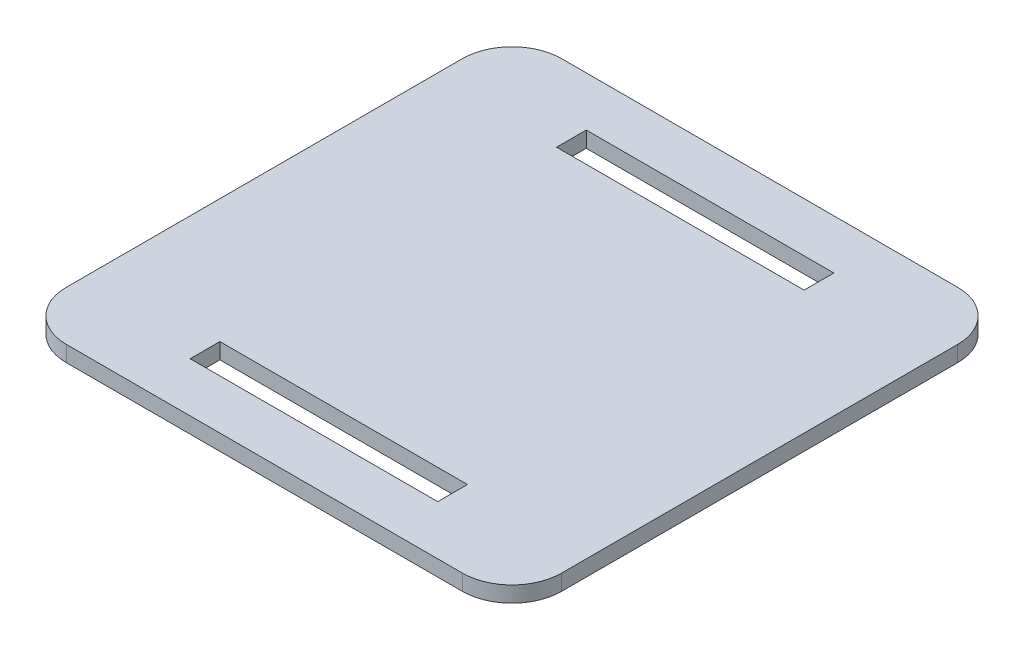
ISO-10303-21;
HEADER;
FILE_DESCRIPTION(('STEP AP214'),'2;1');
FILE_NAME('part.step','',(''),(''),'','','');
FILE_SCHEMA(('AUTOMOTIVE_DESIGN { 1 0 10303 214 1 1 1 1 }'));
ENDSEC;
DATA;
#1=APPLICATION_CONTEXT('core data for automotive mechanical design processes');
#2=APPLICATION_PROTOCOL_DEFINITION('international standard','automotive_design',2000,#1);
#3=PRODUCT_CONTEXT('',#1,'mechanical');
#4=PRODUCT('Part','Part','',(#3));
#5=PRODUCT_RELATED_PRODUCT_CATEGORY('part','',(#4));
#6=PRODUCT_DEFINITION_FORMATION('','',#4);
#7=PRODUCT_DEFINITION_CONTEXT('part definition',#1,'design');
#8=PRODUCT_DEFINITION('design','',#6,#7);
#9=PRODUCT_DEFINITION_SHAPE('','',#8);
#10=(LENGTH_UNIT() NAMED_UNIT(*) SI_UNIT(.MILLI.,.METRE.));
#11=(NAMED_UNIT(*) PLANE_ANGLE_UNIT() SI_UNIT($,.RADIAN.));
#12=(NAMED_UNIT(*) SI_UNIT($,.STERADIAN.) SOLID_ANGLE_UNIT());
#13=UNCERTAINTY_MEASURE_WITH_UNIT(LENGTH_MEASURE(1.E-05),#10,'distance_accuracy_value','');
#14=(GEOMETRIC_REPRESENTATION_CONTEXT(3) GLOBAL_UNCERTAINTY_ASSIGNED_CONTEXT((#13)) GLOBAL_UNIT_ASSIGNED_CONTEXT((#10,
#11,#12)) REPRESENTATION_CONTEXT('',''));
#15=CARTESIAN_POINT('',(0.,0.,0.));
#16=DIRECTION('',(0.,0.,1.));
#17=DIRECTION('',(1.,0.,0.));
#18=AXIS2_PLACEMENT_3D('',#15,#16,#17);
#19=CARTESIAN_POINT('',(0.,1.6,0.));
#20=DIRECTION('',(0.,0.,-1.));
#21=DIRECTION('',(-1.,0.,0.));
#22=AXIS2_PLACEMENT_3D('',#19,#20,#21);
#23=PLANE('',#22);
#24=DIRECTION('',(1.,0.,0.));
#25=VECTOR('',#24,1.);
#26=CARTESIAN_POINT('',(0.,0.,0.));
#27=LINE('',#26,#25);
#28=CARTESIAN_POINT('',(5.,0.,0.));
#29=VERTEX_POINT('',#28);
#30=CARTESIAN_POINT('',(45.,0.,0.));
#31=VERTEX_POINT('',#30);
#32=EDGE_CURVE('E187',#29,#31,#27,.T.);
#33=ORIENTED_EDGE('',*,*,#32,.T.);
#34=DIRECTION('',(0.,-1.,0.));
#35=VECTOR('',#34,1.);
#36=CARTESIAN_POINT('',(45.,1.6,0.));
#37=LINE('',#36,#35);
#38=CARTESIAN_POINT('',(45.,1.6,0.));
#39=VERTEX_POINT('',#38);
#40=EDGE_CURVE('E252',#31,#39,#37,.F.);
#41=ORIENTED_EDGE('',*,*,#40,.T.);
#42=DIRECTION('',(1.,0.,0.));
#43=VECTOR('',#42,1.);
#44=CARTESIAN_POINT('',(0.,1.6,0.));
#45=LINE('',#44,#43);
#46=CARTESIAN_POINT('',(5.,1.6,0.));
#47=VERTEX_POINT('',#46);
#48=EDGE_CURVE('E222',#47,#39,#45,.T.);
#49=ORIENTED_EDGE('',*,*,#48,.F.);
#50=DIRECTION('',(0.,-1.,0.));
#51=VECTOR('',#50,1.);
#52=CARTESIAN_POINT('',(5.,1.6,0.));
#53=LINE('',#52,#51);
#54=EDGE_CURVE('E249',#47,#29,#53,.T.);
#55=ORIENTED_EDGE('',*,*,#54,.T.);
#56=EDGE_LOOP('',(#33,#41,#49,#55));
#57=FACE_BOUND('',#56,.T.);
#58=ADVANCED_FACE('F33',(#57),#23,.F.);
#59=CARTESIAN_POINT('',(50.,1.6,0.));
#60=DIRECTION('',(-1.,0.,0.));
#61=DIRECTION('',(0.,0.,1.));
#62=AXIS2_PLACEMENT_3D('',#59,#60,#61);
#63=PLANE('',#62);
#64=DIRECTION('',(0.,0.,-1.));
#65=VECTOR('',#64,1.);
#66=CARTESIAN_POINT('',(50.,0.,0.));
#67=LINE('',#66,#65);
#68=CARTESIAN_POINT('',(50.,0.,-5.));
#69=VERTEX_POINT('',#68);
#70=CARTESIAN_POINT('',(50.,0.,-45.));
#71=VERTEX_POINT('',#70);
#72=EDGE_CURVE('E236',#69,#71,#67,.T.);
#73=ORIENTED_EDGE('',*,*,#72,.T.);
#74=DIRECTION('',(0.,-1.,0.));
#75=VECTOR('',#74,1.);
#76=CARTESIAN_POINT('',(50.,1.6,-45.));
#77=LINE('',#76,#75);
#78=CARTESIAN_POINT('',(50.,1.6,-45.));
#79=VERTEX_POINT('',#78);
#80=EDGE_CURVE('E266',#71,#79,#77,.F.);
#81=ORIENTED_EDGE('',*,*,#80,.T.);
#82=DIRECTION('',(0.,0.,-1.));
#83=VECTOR('',#82,1.);
#84=CARTESIAN_POINT('',(50.,1.6,0.));
#85=LINE('',#84,#83);
#86=CARTESIAN_POINT('',(50.,1.6,-5.));
#87=VERTEX_POINT('',#86);
#88=EDGE_CURVE('E225',#87,#79,#85,.T.);
#89=ORIENTED_EDGE('',*,*,#88,.F.);
#90=DIRECTION('',(0.,-1.,0.));
#91=VECTOR('',#90,1.);
#92=CARTESIAN_POINT('',(50.,1.6,-5.));
#93=LINE('',#92,#91);
#94=EDGE_CURVE('E233',#87,#69,#93,.T.);
#95=ORIENTED_EDGE('',*,*,#94,.T.);
#96=EDGE_LOOP('',(#73,#81,#89,#95));
#97=FACE_BOUND('',#96,.T.);
#98=ADVANCED_FACE('F297',(#97),#63,.F.);
#99=CARTESIAN_POINT('',(0.,1.6,-50.));
#100=DIRECTION('',(0.,0.,1.));
#101=DIRECTION('',(1.,0.,0.));
#102=AXIS2_PLACEMENT_3D('',#99,#100,#101);
#103=PLANE('',#102);
#104=DIRECTION('',(-1.,0.,0.));
#105=VECTOR('',#104,1.);
#106=CARTESIAN_POINT('',(0.,0.,-50.));
#107=LINE('',#106,#105);
#108=CARTESIAN_POINT('',(45.,0.,-50.));
#109=VERTEX_POINT('',#108);
#110=CARTESIAN_POINT('',(5.,0.,-50.));
#111=VERTEX_POINT('',#110);
#112=EDGE_CURVE('E239',#109,#111,#107,.T.);
#113=ORIENTED_EDGE('',*,*,#112,.T.);
#114=DIRECTION('',(0.,-1.,0.));
#115=VECTOR('',#114,1.);
#116=CARTESIAN_POINT('',(5.,1.6,-50.));
#117=LINE('',#116,#115);
#118=CARTESIAN_POINT('',(5.,1.6,-50.));
#119=VERTEX_POINT('',#118);
#120=EDGE_CURVE('E41',#111,#119,#117,.F.);
#121=ORIENTED_EDGE('',*,*,#120,.T.);
#122=DIRECTION('',(-1.,0.,0.));
#123=VECTOR('',#122,1.);
#124=CARTESIAN_POINT('',(0.,1.6,-50.));
#125=LINE('',#124,#123);
#126=CARTESIAN_POINT('',(45.,1.6,-50.));
#127=VERTEX_POINT('',#126);
#128=EDGE_CURVE('E229',#127,#119,#125,.T.);
#129=ORIENTED_EDGE('',*,*,#128,.F.);
#130=DIRECTION('',(0.,-1.,0.));
#131=VECTOR('',#130,1.);
#132=CARTESIAN_POINT('',(45.,1.6,-50.));
#133=LINE('',#132,#131);
#134=EDGE_CURVE('E261',#127,#109,#133,.T.);
#135=ORIENTED_EDGE('',*,*,#134,.T.);
#136=EDGE_LOOP('',(#113,#121,#129,#135));
#137=FACE_BOUND('',#136,.T.);
#138=ADVANCED_FACE('F303',(#137),#103,.F.);
#139=CARTESIAN_POINT('',(0.,1.6,0.));
#140=DIRECTION('',(1.,0.,0.));
#141=DIRECTION('',(0.,0.,-1.));
#142=AXIS2_PLACEMENT_3D('',#139,#140,#141);
#143=PLANE('',#142);
#144=DIRECTION('',(0.,0.,1.));
#145=VECTOR('',#144,1.);
#146=CARTESIAN_POINT('',(0.,1.6,0.));
#147=LINE('',#146,#145);
#148=CARTESIAN_POINT('',(0.,1.6,-45.));
#149=VERTEX_POINT('',#148);
#150=CARTESIAN_POINT('',(0.,1.6,-5.));
#151=VERTEX_POINT('',#150);
#152=EDGE_CURVE('E231',#149,#151,#147,.T.);
#153=ORIENTED_EDGE('',*,*,#152,.F.);
#154=DIRECTION('',(0.,-1.,0.));
#155=VECTOR('',#154,1.);
#156=CARTESIAN_POINT('',(0.,1.6,-45.));
#157=LINE('',#156,#155);
#158=CARTESIAN_POINT('',(0.,0.,-45.));
#159=VERTEX_POINT('',#158);
#160=EDGE_CURVE('E270',#149,#159,#157,.T.);
#161=ORIENTED_EDGE('',*,*,#160,.T.);
#162=DIRECTION('',(0.,0.,1.));
#163=VECTOR('',#162,1.);
#164=CARTESIAN_POINT('',(0.,0.,0.));
#165=LINE('',#164,#163);
#166=CARTESIAN_POINT('',(0.,0.,-5.));
#167=VERTEX_POINT('',#166);
#168=EDGE_CURVE('E226',#159,#167,#165,.T.);
#169=ORIENTED_EDGE('',*,*,#168,.T.);
#170=DIRECTION('',(0.,-1.,0.));
#171=VECTOR('',#170,1.);
#172=CARTESIAN_POINT('',(0.,1.6,-5.));
#173=LINE('',#172,#171);
#174=EDGE_CURVE('E258',#167,#151,#173,.F.);
#175=ORIENTED_EDGE('',*,*,#174,.T.);
#176=EDGE_LOOP('',(#153,#161,#169,#175));
#177=FACE_BOUND('',#176,.T.);
#178=ADVANCED_FACE('F276',(#177),#143,.F.);
#179=CARTESIAN_POINT('',(0.,1.6,0.));
#180=DIRECTION('',(0.,1.,0.));
#181=DIRECTION('',(0.,0.,1.));
#182=AXIS2_PLACEMENT_3D('',#179,#180,#181);
#183=PLANE('',#182);
#184=DIRECTION('',(1.,0.,0.));
#185=VECTOR('',#184,1.);
#186=CARTESIAN_POINT('',(0.,1.6,-8.));
#187=LINE('',#186,#185);
#188=CARTESIAN_POINT('',(12.5,1.6,-8.));
#189=VERTEX_POINT('',#188);
#190=CARTESIAN_POINT('',(37.5,1.6,-8.));
#191=VERTEX_POINT('',#190);
#192=EDGE_CURVE('E150',#189,#191,#187,.T.);
#193=ORIENTED_EDGE('',*,*,#192,.T.);
#194=DIRECTION('',(0.,0.,1.));
#195=VECTOR('',#194,1.);
#196=CARTESIAN_POINT('',(37.5,1.6,0.));
#197=LINE('',#196,#195);
#198=CARTESIAN_POINT('',(37.5,1.6,-5.));
#199=VERTEX_POINT('',#198);
#200=EDGE_CURVE('E161',#191,#199,#197,.T.);
#201=ORIENTED_EDGE('',*,*,#200,.T.);
#202=DIRECTION('',(1.,0.,0.));
#203=VECTOR('',#202,1.);
#204=CARTESIAN_POINT('',(0.,1.6,-5.));
#205=LINE('',#204,#203);
#206=CARTESIAN_POINT('',(12.5,1.6,-5.));
#207=VERTEX_POINT('',#206);
#208=EDGE_CURVE('E166',#207,#199,#205,.T.);
#209=ORIENTED_EDGE('',*,*,#208,.F.);
#210=DIRECTION('',(0.,0.,-1.));
#211=VECTOR('',#210,1.);
#212=CARTESIAN_POINT('',(12.5,1.6,0.));
#213=LINE('',#212,#211);
#214=EDGE_CURVE('E158',#207,#189,#213,.T.);
#215=ORIENTED_EDGE('',*,*,#214,.T.);
#216=EDGE_LOOP('',(#193,#201,#209,#215));
#217=FACE_BOUND('',#216,.T.);
#218=DIRECTION('',(0.,0.,1.));
#219=VECTOR('',#218,1.);
#220=CARTESIAN_POINT('',(37.5,1.6,0.));
#221=LINE('',#220,#219);
#222=CARTESIAN_POINT('',(37.5,1.6,-45.));
#223=VERTEX_POINT('',#222);
#224=CARTESIAN_POINT('',(37.5,1.6,-42.));
#225=VERTEX_POINT('',#224);
#226=EDGE_CURVE('E191',#223,#225,#221,.T.);
#227=ORIENTED_EDGE('',*,*,#226,.T.);
#228=DIRECTION('',(-1.,0.,0.));
#229=VECTOR('',#228,1.);
#230=CARTESIAN_POINT('',(0.,1.6,-42.));
#231=LINE('',#230,#229);
#232=CARTESIAN_POINT('',(12.5,1.6,-42.));
#233=VERTEX_POINT('',#232);
#234=EDGE_CURVE('E194',#225,#233,#231,.T.);
#235=ORIENTED_EDGE('',*,*,#234,.T.);
#236=DIRECTION('',(0.,0.,1.));
#237=VECTOR('',#236,1.);
#238=CARTESIAN_POINT('',(12.5,1.6,0.));
#239=LINE('',#238,#237);
#240=CARTESIAN_POINT('',(12.5,1.6,-45.));
#241=VERTEX_POINT('',#240);
#242=EDGE_CURVE('E198',#241,#233,#239,.T.);
#243=ORIENTED_EDGE('',*,*,#242,.F.);
#244=DIRECTION('',(1.,0.,0.));
#245=VECTOR('',#244,1.);
#246=CARTESIAN_POINT('',(0.,1.6,-45.));
#247=LINE('',#246,#245);
#248=EDGE_CURVE('E201',#241,#223,#247,.T.);
#249=ORIENTED_EDGE('',*,*,#248,.T.);
#250=EDGE_LOOP('',(#227,#235,#243,#249));
#251=FACE_BOUND('',#250,.T.);
#252=ORIENTED_EDGE('',*,*,#128,.T.);
#253=CARTESIAN_POINT('',(5.,1.6,-45.));
#254=DIRECTION('',(0.,1.,0.));
#255=DIRECTION('',(0.,0.,1.));
#256=AXIS2_PLACEMENT_3D('',#253,#254,#255);
#257=CIRCLE('',#256,5.);
#258=EDGE_CURVE('E11',#119,#149,#257,.T.);
#259=ORIENTED_EDGE('',*,*,#258,.T.);
#260=ORIENTED_EDGE('',*,*,#152,.T.);
#261=CARTESIAN_POINT('',(5.,1.6,-5.));
#262=DIRECTION('',(0.,1.,0.));
#263=DIRECTION('',(0.,0.,1.));
#264=AXIS2_PLACEMENT_3D('',#261,#262,#263);
#265=CIRCLE('',#264,5.);
#266=EDGE_CURVE('E254',#151,#47,#265,.T.);
#267=ORIENTED_EDGE('',*,*,#266,.T.);
#268=ORIENTED_EDGE('',*,*,#48,.T.);
#269=CARTESIAN_POINT('',(45.,1.6,-5.));
#270=DIRECTION('',(0.,1.,0.));
#271=DIRECTION('',(0.,0.,1.));
#272=AXIS2_PLACEMENT_3D('',#269,#270,#271);
#273=CIRCLE('',#272,5.);
#274=EDGE_CURVE('E256',#39,#87,#273,.T.);
#275=ORIENTED_EDGE('',*,*,#274,.T.);
#276=ORIENTED_EDGE('',*,*,#88,.T.);
#277=CARTESIAN_POINT('',(45.,1.6,-45.));
#278=DIRECTION('',(0.,1.,0.));
#279=DIRECTION('',(0.,0.,1.));
#280=AXIS2_PLACEMENT_3D('',#277,#278,#279);
#281=CIRCLE('',#280,5.);
#282=EDGE_CURVE('E268',#79,#127,#281,.T.);
#283=ORIENTED_EDGE('',*,*,#282,.T.);
#284=EDGE_LOOP('',(#252,#259,#260,#267,#268,#275,#276,#283));
#285=FACE_BOUND('',#284,.T.);
#286=ADVANCED_FACE('F168',(#217,#251,#285),#183,.T.);
#287=CARTESIAN_POINT('',(0.,0.,0.));
#288=DIRECTION('',(0.,1.,0.));
#289=DIRECTION('',(0.,0.,1.));
#290=AXIS2_PLACEMENT_3D('',#287,#288,#289);
#291=PLANE('',#290);
#292=DIRECTION('',(0.,0.,1.));
#293=VECTOR('',#292,1.);
#294=CARTESIAN_POINT('',(37.5,0.,0.));
#295=LINE('',#294,#293);
#296=CARTESIAN_POINT('',(37.5,0.,-8.));
#297=VERTEX_POINT('',#296);
#298=CARTESIAN_POINT('',(37.5,0.,-5.));
#299=VERTEX_POINT('',#298);
#300=EDGE_CURVE('E180',#297,#299,#295,.T.);
#301=ORIENTED_EDGE('',*,*,#300,.F.);
#302=DIRECTION('',(1.,0.,0.));
#303=VECTOR('',#302,1.);
#304=CARTESIAN_POINT('',(0.,0.,-8.));
#305=LINE('',#304,#303);
#306=CARTESIAN_POINT('',(12.5,0.,-8.));
#307=VERTEX_POINT('',#306);
#308=EDGE_CURVE('E153',#307,#297,#305,.T.);
#309=ORIENTED_EDGE('',*,*,#308,.F.);
#310=DIRECTION('',(0.,0.,-1.));
#311=VECTOR('',#310,1.);
#312=CARTESIAN_POINT('',(12.5,0.,0.));
#313=LINE('',#312,#311);
#314=CARTESIAN_POINT('',(12.5,0.,-5.));
#315=VERTEX_POINT('',#314);
#316=EDGE_CURVE('E171',#315,#307,#313,.T.);
#317=ORIENTED_EDGE('',*,*,#316,.F.);
#318=DIRECTION('',(1.,0.,0.));
#319=VECTOR('',#318,1.);
#320=CARTESIAN_POINT('',(0.,0.,-5.));
#321=LINE('',#320,#319);
#322=EDGE_CURVE('E174',#315,#299,#321,.T.);
#323=ORIENTED_EDGE('',*,*,#322,.T.);
#324=EDGE_LOOP('',(#301,#309,#317,#323));
#325=FACE_BOUND('',#324,.T.);
#326=DIRECTION('',(-1.,0.,0.));
#327=VECTOR('',#326,1.);
#328=CARTESIAN_POINT('',(0.,0.,-42.));
#329=LINE('',#328,#327);
#330=CARTESIAN_POINT('',(37.5,0.,-42.));
#331=VERTEX_POINT('',#330);
#332=CARTESIAN_POINT('',(12.5,0.,-42.));
#333=VERTEX_POINT('',#332);
#334=EDGE_CURVE('E207',#331,#333,#329,.T.);
#335=ORIENTED_EDGE('',*,*,#334,.F.);
#336=DIRECTION('',(0.,0.,1.));
#337=VECTOR('',#336,1.);
#338=CARTESIAN_POINT('',(37.5,0.,0.));
#339=LINE('',#338,#337);
#340=CARTESIAN_POINT('',(37.5,0.,-45.));
#341=VERTEX_POINT('',#340);
#342=EDGE_CURVE('E205',#341,#331,#339,.T.);
#343=ORIENTED_EDGE('',*,*,#342,.F.);
#344=DIRECTION('',(1.,0.,0.));
#345=VECTOR('',#344,1.);
#346=CARTESIAN_POINT('',(0.,0.,-45.));
#347=LINE('',#346,#345);
#348=CARTESIAN_POINT('',(12.5,0.,-45.));
#349=VERTEX_POINT('',#348);
#350=EDGE_CURVE('E195',#349,#341,#347,.T.);
#351=ORIENTED_EDGE('',*,*,#350,.F.);
#352=DIRECTION('',(0.,0.,1.));
#353=VECTOR('',#352,1.);
#354=CARTESIAN_POINT('',(12.5,0.,0.));
#355=LINE('',#354,#353);
#356=EDGE_CURVE('E210',#349,#333,#355,.T.);
#357=ORIENTED_EDGE('',*,*,#356,.T.);
#358=EDGE_LOOP('',(#335,#343,#351,#357));
#359=FACE_BOUND('',#358,.T.);
#360=ORIENTED_EDGE('',*,*,#168,.F.);
#361=CARTESIAN_POINT('',(5.,0.,-45.));
#362=DIRECTION('',(0.,1.,0.));
#363=DIRECTION('',(0.,0.,1.));
#364=AXIS2_PLACEMENT_3D('',#361,#362,#363);
#365=CIRCLE('',#364,5.);
#366=EDGE_CURVE('E55',#159,#111,#365,.F.);
#367=ORIENTED_EDGE('',*,*,#366,.T.);
#368=ORIENTED_EDGE('',*,*,#112,.F.);
#369=CARTESIAN_POINT('',(45.,0.,-45.));
#370=DIRECTION('',(0.,1.,0.));
#371=DIRECTION('',(0.,0.,1.));
#372=AXIS2_PLACEMENT_3D('',#369,#370,#371);
#373=CIRCLE('',#372,5.);
#374=EDGE_CURVE('E264',#109,#71,#373,.F.);
#375=ORIENTED_EDGE('',*,*,#374,.T.);
#376=ORIENTED_EDGE('',*,*,#72,.F.);
#377=CARTESIAN_POINT('',(45.,0.,-5.));
#378=DIRECTION('',(0.,1.,0.));
#379=DIRECTION('',(0.,0.,1.));
#380=AXIS2_PLACEMENT_3D('',#377,#378,#379);
#381=CIRCLE('',#380,5.);
#382=EDGE_CURVE('E247',#69,#31,#381,.F.);
#383=ORIENTED_EDGE('',*,*,#382,.T.);
#384=ORIENTED_EDGE('',*,*,#32,.F.);
#385=CARTESIAN_POINT('',(5.,0.,-5.));
#386=DIRECTION('',(0.,1.,0.));
#387=DIRECTION('',(0.,0.,1.));
#388=AXIS2_PLACEMENT_3D('',#385,#386,#387);
#389=CIRCLE('',#388,5.);
#390=EDGE_CURVE('E244',#29,#167,#389,.F.);
#391=ORIENTED_EDGE('',*,*,#390,.T.);
#392=EDGE_LOOP('',(#360,#367,#368,#375,#376,#383,#384,#391));
#393=FACE_BOUND('',#392,.T.);
#394=ADVANCED_FACE('F279',(#325,#359,#393),#291,.F.);
#395=CARTESIAN_POINT('',(37.5,1.6,0.));
#396=DIRECTION('',(1.,0.,0.));
#397=DIRECTION('',(0.,0.,-1.));
#398=AXIS2_PLACEMENT_3D('',#395,#396,#397);
#399=PLANE('',#398);
#400=ORIENTED_EDGE('',*,*,#342,.T.);
#401=DIRECTION('',(0.,-1.,0.));
#402=VECTOR('',#401,1.);
#403=CARTESIAN_POINT('',(37.5,1.6,-42.));
#404=LINE('',#403,#402);
#405=EDGE_CURVE('E204',#225,#331,#404,.T.);
#406=ORIENTED_EDGE('',*,*,#405,.F.);
#407=ORIENTED_EDGE('',*,*,#226,.F.);
#408=DIRECTION('',(0.,-1.,0.));
#409=VECTOR('',#408,1.);
#410=CARTESIAN_POINT('',(37.5,1.6,-45.));
#411=LINE('',#410,#409);
#412=EDGE_CURVE('E181',#223,#341,#411,.T.);
#413=ORIENTED_EDGE('',*,*,#412,.T.);
#414=EDGE_LOOP('',(#400,#406,#407,#413));
#415=FACE_BOUND('',#414,.T.);
#416=ADVANCED_FACE('F363',(#415),#399,.F.);
#417=CARTESIAN_POINT('',(0.,1.6,-45.));
#418=DIRECTION('',(0.,0.,-1.));
#419=DIRECTION('',(-1.,0.,0.));
#420=AXIS2_PLACEMENT_3D('',#417,#418,#419);
#421=PLANE('',#420);
#422=ORIENTED_EDGE('',*,*,#350,.T.);
#423=ORIENTED_EDGE('',*,*,#412,.F.);
#424=ORIENTED_EDGE('',*,*,#248,.F.);
#425=DIRECTION('',(0.,-1.,0.));
#426=VECTOR('',#425,1.);
#427=CARTESIAN_POINT('',(12.5,1.6,-45.));
#428=LINE('',#427,#426);
#429=EDGE_CURVE('E216',#241,#349,#428,.T.);
#430=ORIENTED_EDGE('',*,*,#429,.T.);
#431=EDGE_LOOP('',(#422,#423,#424,#430));
#432=FACE_BOUND('',#431,.T.);
#433=ADVANCED_FACE('F377',(#432),#421,.F.);
#434=CARTESIAN_POINT('',(12.5,1.6,0.));
#435=DIRECTION('',(1.,0.,0.));
#436=DIRECTION('',(0.,0.,-1.));
#437=AXIS2_PLACEMENT_3D('',#434,#435,#436);
#438=PLANE('',#437);
#439=ORIENTED_EDGE('',*,*,#356,.F.);
#440=ORIENTED_EDGE('',*,*,#429,.F.);
#441=ORIENTED_EDGE('',*,*,#242,.T.);
#442=DIRECTION('',(0.,-1.,0.));
#443=VECTOR('',#442,1.);
#444=CARTESIAN_POINT('',(12.5,1.6,-42.));
#445=LINE('',#444,#443);
#446=EDGE_CURVE('E218',#233,#333,#445,.T.);
#447=ORIENTED_EDGE('',*,*,#446,.T.);
#448=EDGE_LOOP('',(#439,#440,#441,#447));
#449=FACE_BOUND('',#448,.T.);
#450=ADVANCED_FACE('F384',(#449),#438,.T.);
#451=CARTESIAN_POINT('',(0.,1.6,-42.));
#452=DIRECTION('',(0.,0.,1.));
#453=DIRECTION('',(1.,0.,0.));
#454=AXIS2_PLACEMENT_3D('',#451,#452,#453);
#455=PLANE('',#454);
#456=ORIENTED_EDGE('',*,*,#334,.T.);
#457=ORIENTED_EDGE('',*,*,#446,.F.);
#458=ORIENTED_EDGE('',*,*,#234,.F.);
#459=ORIENTED_EDGE('',*,*,#405,.T.);
#460=EDGE_LOOP('',(#456,#457,#458,#459));
#461=FACE_BOUND('',#460,.T.);
#462=ADVANCED_FACE('F392',(#461),#455,.F.);
#463=CARTESIAN_POINT('',(0.,1.6,-8.));
#464=DIRECTION('',(0.,0.,-1.));
#465=DIRECTION('',(-1.,0.,0.));
#466=AXIS2_PLACEMENT_3D('',#463,#464,#465);
#467=PLANE('',#466);
#468=ORIENTED_EDGE('',*,*,#308,.T.);
#469=DIRECTION('',(0.,-1.,0.));
#470=VECTOR('',#469,1.);
#471=CARTESIAN_POINT('',(37.5,1.6,-8.));
#472=LINE('',#471,#470);
#473=EDGE_CURVE('E146',#191,#297,#472,.T.);
#474=ORIENTED_EDGE('',*,*,#473,.F.);
#475=ORIENTED_EDGE('',*,*,#192,.F.);
#476=DIRECTION('',(0.,-1.,0.));
#477=VECTOR('',#476,1.);
#478=CARTESIAN_POINT('',(12.5,1.6,-8.));
#479=LINE('',#478,#477);
#480=EDGE_CURVE('E185',#189,#307,#479,.T.);
#481=ORIENTED_EDGE('',*,*,#480,.T.);
#482=EDGE_LOOP('',(#468,#474,#475,#481));
#483=FACE_BOUND('',#482,.T.);
#484=ADVANCED_FACE('F148',(#483),#467,.F.);
#485=CARTESIAN_POINT('',(12.5,1.6,0.));
#486=DIRECTION('',(-1.,0.,0.));
#487=DIRECTION('',(0.,0.,1.));
#488=AXIS2_PLACEMENT_3D('',#485,#486,#487);
#489=PLANE('',#488);
#490=ORIENTED_EDGE('',*,*,#316,.T.);
#491=ORIENTED_EDGE('',*,*,#480,.F.);
#492=ORIENTED_EDGE('',*,*,#214,.F.);
#493=DIRECTION('',(0.,-1.,0.));
#494=VECTOR('',#493,1.);
#495=CARTESIAN_POINT('',(12.5,1.6,-5.));
#496=LINE('',#495,#494);
#497=EDGE_CURVE('E188',#207,#315,#496,.T.);
#498=ORIENTED_EDGE('',*,*,#497,.T.);
#499=EDGE_LOOP('',(#490,#491,#492,#498));
#500=FACE_BOUND('',#499,.T.);
#501=ADVANCED_FACE('F407',(#500),#489,.F.);
#502=CARTESIAN_POINT('',(0.,1.6,-5.));
#503=DIRECTION('',(0.,0.,-1.));
#504=DIRECTION('',(-1.,0.,0.));
#505=AXIS2_PLACEMENT_3D('',#502,#503,#504);
#506=PLANE('',#505);
#507=ORIENTED_EDGE('',*,*,#322,.F.);
#508=ORIENTED_EDGE('',*,*,#497,.F.);
#509=ORIENTED_EDGE('',*,*,#208,.T.);
#510=DIRECTION('',(0.,-1.,0.));
#511=VECTOR('',#510,1.);
#512=CARTESIAN_POINT('',(37.5,1.6,-5.));
#513=LINE('',#512,#511);
#514=EDGE_CURVE('E157',#199,#299,#513,.T.);
#515=ORIENTED_EDGE('',*,*,#514,.T.);
#516=EDGE_LOOP('',(#507,#508,#509,#515));
#517=FACE_BOUND('',#516,.T.);
#518=ADVANCED_FACE('F414',(#517),#506,.T.);
#519=CARTESIAN_POINT('',(37.5,1.6,0.));
#520=DIRECTION('',(1.,0.,0.));
#521=DIRECTION('',(0.,0.,-1.));
#522=AXIS2_PLACEMENT_3D('',#519,#520,#521);
#523=PLANE('',#522);
#524=ORIENTED_EDGE('',*,*,#300,.T.);
#525=ORIENTED_EDGE('',*,*,#514,.F.);
#526=ORIENTED_EDGE('',*,*,#200,.F.);
#527=ORIENTED_EDGE('',*,*,#473,.T.);
#528=EDGE_LOOP('',(#524,#525,#526,#527));
#529=FACE_BOUND('',#528,.T.);
#530=ADVANCED_FACE('F162',(#529),#523,.F.);
#531=CARTESIAN_POINT('',(45.,1.6,-5.));
#532=DIRECTION('',(0.,-1.,0.));
#533=DIRECTION('',(0.,0.,-1.));
#534=AXIS2_PLACEMENT_3D('',#531,#532,#533);
#535=CYLINDRICAL_SURFACE('',#534,5.);
#536=ORIENTED_EDGE('',*,*,#274,.F.);
#537=ORIENTED_EDGE('',*,*,#40,.F.);
#538=ORIENTED_EDGE('',*,*,#382,.F.);
#539=ORIENTED_EDGE('',*,*,#94,.F.);
#540=EDGE_LOOP('',(#536,#537,#538,#539));
#541=FACE_BOUND('',#540,.T.);
#542=ADVANCED_FACE('F292',(#541),#535,.T.);
#543=CARTESIAN_POINT('',(5.,1.6,-5.));
#544=DIRECTION('',(0.,-1.,0.));
#545=DIRECTION('',(0.,0.,-1.));
#546=AXIS2_PLACEMENT_3D('',#543,#544,#545);
#547=CYLINDRICAL_SURFACE('',#546,5.);
#548=ORIENTED_EDGE('',*,*,#266,.F.);
#549=ORIENTED_EDGE('',*,*,#174,.F.);
#550=ORIENTED_EDGE('',*,*,#390,.F.);
#551=ORIENTED_EDGE('',*,*,#54,.F.);
#552=EDGE_LOOP('',(#548,#549,#550,#551));
#553=FACE_BOUND('',#552,.T.);
#554=ADVANCED_FACE('F285',(#553),#547,.T.);
#555=CARTESIAN_POINT('',(45.,1.6,-45.));
#556=DIRECTION('',(0.,-1.,0.));
#557=DIRECTION('',(0.,0.,-1.));
#558=AXIS2_PLACEMENT_3D('',#555,#556,#557);
#559=CYLINDRICAL_SURFACE('',#558,5.);
#560=ORIENTED_EDGE('',*,*,#282,.F.);
#561=ORIENTED_EDGE('',*,*,#80,.F.);
#562=ORIENTED_EDGE('',*,*,#374,.F.);
#563=ORIENTED_EDGE('',*,*,#134,.F.);
#564=EDGE_LOOP('',(#560,#561,#562,#563));
#565=FACE_BOUND('',#564,.T.);
#566=ADVANCED_FACE('F301',(#565),#559,.T.);
#567=CARTESIAN_POINT('',(5.,1.6,-45.));
#568=DIRECTION('',(0.,-1.,0.));
#569=DIRECTION('',(0.,0.,-1.));
#570=AXIS2_PLACEMENT_3D('',#567,#568,#569);
#571=CYLINDRICAL_SURFACE('',#570,5.);
#572=ORIENTED_EDGE('',*,*,#258,.F.);
#573=ORIENTED_EDGE('',*,*,#120,.F.);
#574=ORIENTED_EDGE('',*,*,#366,.F.);
#575=ORIENTED_EDGE('',*,*,#160,.F.);
#576=EDGE_LOOP('',(#572,#573,#574,#575));
#577=FACE_BOUND('',#576,.T.);
#578=ADVANCED_FACE('F35',(#577),#571,.T.);
#579=CLOSED_SHELL('',(#58,#98,#138,#178,#286,#394,#416,#433,#450,#462,#484,#501,#518,#530,#542,
#554,#566,#578));
#580=MANIFOLD_SOLID_BREP('B2',#579);
#581=ADVANCED_BREP_SHAPE_REPRESENTATION('',(#18,#580),#14);
#582=SHAPE_DEFINITION_REPRESENTATION(#9,#581);
ENDSEC;
END-ISO-10303-21;
